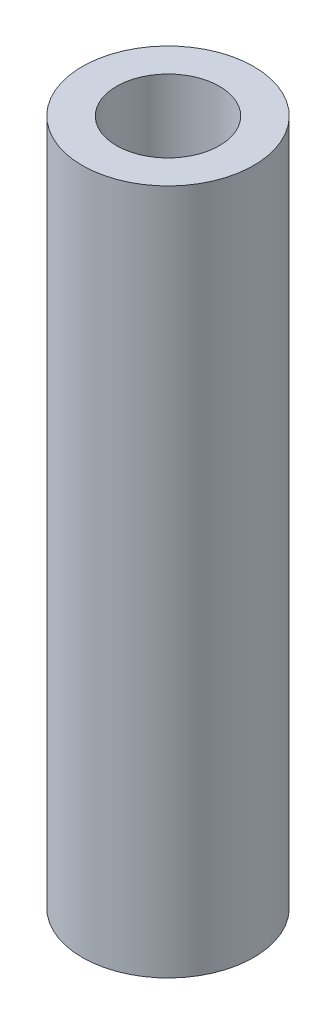
ISO-10303-21;
HEADER;
FILE_DESCRIPTION(('STEP AP214'),'2;1');
FILE_NAME('part.step','',(''),(''),'','','');
FILE_SCHEMA(('AUTOMOTIVE_DESIGN { 1 0 10303 214 1 1 1 1 }'));
ENDSEC;
DATA;
#1=APPLICATION_CONTEXT('core data for automotive mechanical design processes');
#2=APPLICATION_PROTOCOL_DEFINITION('international standard','automotive_design',2000,#1);
#3=PRODUCT_CONTEXT('',#1,'mechanical');
#4=PRODUCT('Part','Part','',(#3));
#5=PRODUCT_RELATED_PRODUCT_CATEGORY('part','',(#4));
#6=PRODUCT_DEFINITION_FORMATION('','',#4);
#7=PRODUCT_DEFINITION_CONTEXT('part definition',#1,'design');
#8=PRODUCT_DEFINITION('design','',#6,#7);
#9=PRODUCT_DEFINITION_SHAPE('','',#8);
#10=(LENGTH_UNIT() NAMED_UNIT(*) SI_UNIT(.MILLI.,.METRE.));
#11=(NAMED_UNIT(*) PLANE_ANGLE_UNIT() SI_UNIT($,.RADIAN.));
#12=(NAMED_UNIT(*) SI_UNIT($,.STERADIAN.) SOLID_ANGLE_UNIT());
#13=UNCERTAINTY_MEASURE_WITH_UNIT(LENGTH_MEASURE(1.E-05),#10,'distance_accuracy_value','');
#14=(GEOMETRIC_REPRESENTATION_CONTEXT(3) GLOBAL_UNCERTAINTY_ASSIGNED_CONTEXT((#13)) GLOBAL_UNIT_ASSIGNED_CONTEXT((#10,
#11,#12)) REPRESENTATION_CONTEXT('',''));
#15=CARTESIAN_POINT('',(0.,0.,0.));
#16=DIRECTION('',(0.,0.,1.));
#17=DIRECTION('',(1.,0.,0.));
#18=AXIS2_PLACEMENT_3D('',#15,#16,#17);
#19=CARTESIAN_POINT('',(0.,20.,0.));
#20=DIRECTION('',(0.,1.,0.));
#21=DIRECTION('',(0.,0.,1.));
#22=AXIS2_PLACEMENT_3D('',#19,#20,#21);
#23=PLANE('',#22);
#24=CARTESIAN_POINT('',(0.,20.,0.));
#25=DIRECTION('',(0.,1.,0.));
#26=DIRECTION('',(0.,0.,1.));
#27=AXIS2_PLACEMENT_3D('',#24,#25,#26);
#28=CIRCLE('',#27,2.5);
#29=CARTESIAN_POINT('',(0.,20.,2.5));
#30=VERTEX_POINT('',#29);
#31=EDGE_CURVE('E10',#30,#30,#28,.T.);
#32=ORIENTED_EDGE('',*,*,#31,.T.);
#33=EDGE_LOOP('',(#32));
#34=FACE_BOUND('',#33,.T.);
#35=CARTESIAN_POINT('',(0.,20.,0.));
#36=DIRECTION('',(0.,1.,0.));
#37=DIRECTION('',(0.,0.,1.));
#38=AXIS2_PLACEMENT_3D('',#35,#36,#37);
#39=CIRCLE('',#38,1.5);
#40=CARTESIAN_POINT('',(0.,20.,1.5));
#41=VERTEX_POINT('',#40);
#42=EDGE_CURVE('E50',#41,#41,#39,.T.);
#43=ORIENTED_EDGE('',*,*,#42,.F.);
#44=EDGE_LOOP('',(#43));
#45=FACE_BOUND('',#44,.T.);
#46=ADVANCED_FACE('F37',(#34,#45),#23,.T.);
#47=CARTESIAN_POINT('',(0.,0.,0.));
#48=DIRECTION('',(0.,1.,0.));
#49=DIRECTION('',(0.,0.,1.));
#50=AXIS2_PLACEMENT_3D('',#47,#48,#49);
#51=PLANE('',#50);
#52=CARTESIAN_POINT('',(0.,0.,0.));
#53=DIRECTION('',(0.,1.,0.));
#54=DIRECTION('',(0.,0.,1.));
#55=AXIS2_PLACEMENT_3D('',#52,#53,#54);
#56=CIRCLE('',#55,2.5);
#57=CARTESIAN_POINT('',(0.,0.,2.5));
#58=VERTEX_POINT('',#57);
#59=EDGE_CURVE('E41',#58,#58,#56,.T.);
#60=ORIENTED_EDGE('',*,*,#59,.F.);
#61=EDGE_LOOP('',(#60));
#62=FACE_BOUND('',#61,.T.);
#63=CARTESIAN_POINT('',(0.,0.,0.));
#64=DIRECTION('',(0.,1.,0.));
#65=DIRECTION('',(0.,0.,1.));
#66=AXIS2_PLACEMENT_3D('',#63,#64,#65);
#67=CIRCLE('',#66,1.5);
#68=CARTESIAN_POINT('',(0.,0.,1.5));
#69=VERTEX_POINT('',#68);
#70=EDGE_CURVE('E52',#69,#69,#67,.T.);
#71=ORIENTED_EDGE('',*,*,#70,.T.);
#72=EDGE_LOOP('',(#71));
#73=FACE_BOUND('',#72,.T.);
#74=ADVANCED_FACE('F64',(#62,#73),#51,.F.);
#75=CARTESIAN_POINT('',(0.,20.,0.));
#76=DIRECTION('',(0.,-1.,0.));
#77=DIRECTION('',(0.,0.,-1.));
#78=AXIS2_PLACEMENT_3D('',#75,#76,#77);
#79=CYLINDRICAL_SURFACE('',#78,2.5);
#80=ORIENTED_EDGE('',*,*,#31,.F.);
#81=EDGE_LOOP('',(#80));
#82=FACE_BOUND('',#81,.T.);
#83=ORIENTED_EDGE('',*,*,#59,.T.);
#84=EDGE_LOOP('',(#83));
#85=FACE_BOUND('',#84,.T.);
#86=ADVANCED_FACE('F39',(#82,#85),#79,.T.);
#87=CARTESIAN_POINT('',(0.,20.,0.));
#88=DIRECTION('',(0.,-1.,0.));
#89=DIRECTION('',(0.,0.,-1.));
#90=AXIS2_PLACEMENT_3D('',#87,#88,#89);
#91=CYLINDRICAL_SURFACE('',#90,1.5);
#92=ORIENTED_EDGE('',*,*,#42,.T.);
#93=EDGE_LOOP('',(#92));
#94=FACE_BOUND('',#93,.T.);
#95=ORIENTED_EDGE('',*,*,#70,.F.);
#96=EDGE_LOOP('',(#95));
#97=FACE_BOUND('',#96,.T.);
#98=ADVANCED_FACE('F60',(#94,#97),#91,.F.);
#99=CLOSED_SHELL('',(#46,#74,#86,#98));
#100=MANIFOLD_SOLID_BREP('B2',#99);
#101=ADVANCED_BREP_SHAPE_REPRESENTATION('',(#18,#100),#14);
#102=SHAPE_DEFINITION_REPRESENTATION(#9,#101);
ENDSEC;
END-ISO-10303-21;
